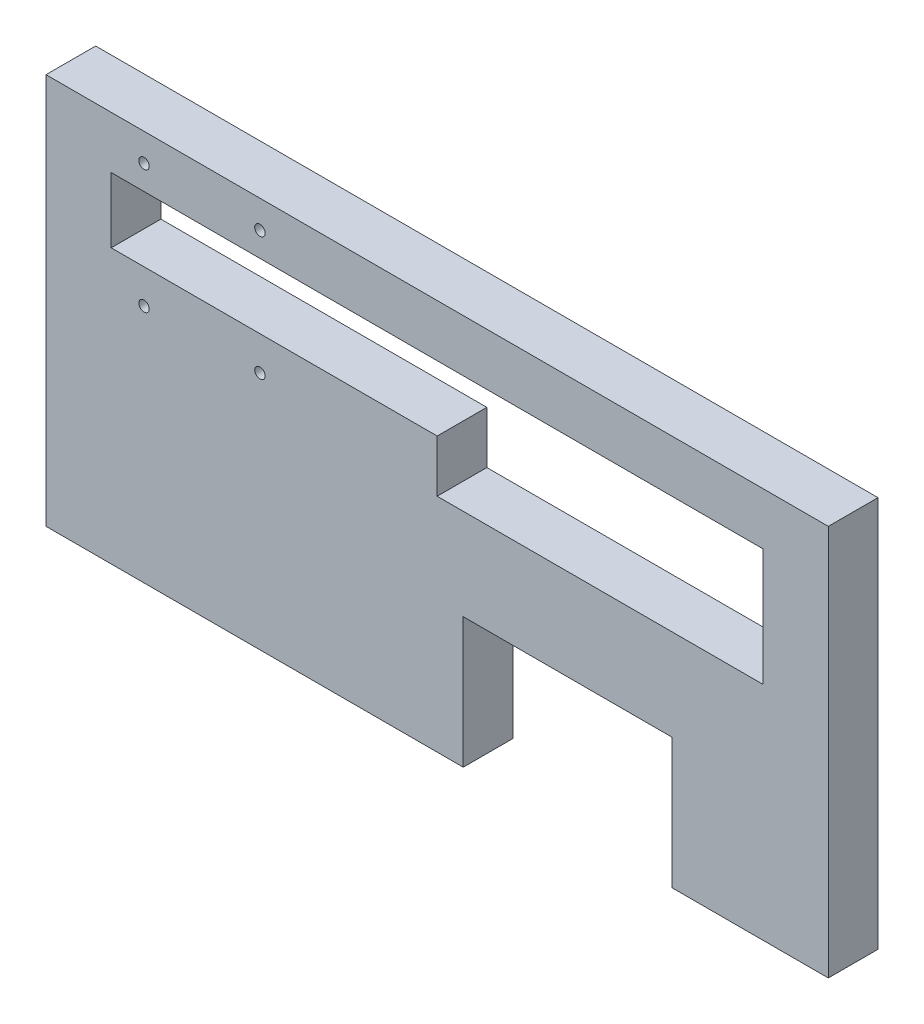
ISO-10303-21;
HEADER;
FILE_DESCRIPTION(('STEP AP214'),'2;1');
FILE_NAME('part.step','',(''),(''),'','','');
FILE_SCHEMA(('AUTOMOTIVE_DESIGN { 1 0 10303 214 1 1 1 1 }'));
ENDSEC;
DATA;
#1=APPLICATION_CONTEXT('core data for automotive mechanical design processes');
#2=APPLICATION_PROTOCOL_DEFINITION('international standard','automotive_design',2000,#1);
#3=PRODUCT_CONTEXT('',#1,'mechanical');
#4=PRODUCT('Part','Part','',(#3));
#5=PRODUCT_RELATED_PRODUCT_CATEGORY('part','',(#4));
#6=PRODUCT_DEFINITION_FORMATION('','',#4);
#7=PRODUCT_DEFINITION_CONTEXT('part definition',#1,'design');
#8=PRODUCT_DEFINITION('design','',#6,#7);
#9=PRODUCT_DEFINITION_SHAPE('','',#8);
#10=(LENGTH_UNIT() NAMED_UNIT(*) SI_UNIT(.MILLI.,.METRE.));
#11=(NAMED_UNIT(*) PLANE_ANGLE_UNIT() SI_UNIT($,.RADIAN.));
#12=(NAMED_UNIT(*) SI_UNIT($,.STERADIAN.) SOLID_ANGLE_UNIT());
#13=UNCERTAINTY_MEASURE_WITH_UNIT(LENGTH_MEASURE(1.E-05),#10,'distance_accuracy_value','');
#14=(GEOMETRIC_REPRESENTATION_CONTEXT(3) GLOBAL_UNCERTAINTY_ASSIGNED_CONTEXT((#13)) GLOBAL_UNIT_ASSIGNED_CONTEXT((#10,
#11,#12)) REPRESENTATION_CONTEXT('',''));
#15=CARTESIAN_POINT('',(0.,0.,0.));
#16=DIRECTION('',(0.,0.,1.));
#17=DIRECTION('',(1.,0.,0.));
#18=AXIS2_PLACEMENT_3D('',#15,#16,#17);
#19=CARTESIAN_POINT('',(0.,0.,-19.05));
#20=DIRECTION('',(0.,-1.,0.));
#21=DIRECTION('',(0.,0.,-1.));
#22=AXIS2_PLACEMENT_3D('',#19,#20,#21);
#23=PLANE('',#22);
#24=DIRECTION('',(0.,0.,1.));
#25=VECTOR('',#24,1.);
#26=CARTESIAN_POINT('',(240.,0.,-19.05));
#27=LINE('',#26,#25);
#28=CARTESIAN_POINT('',(240.,0.,-19.05));
#29=VERTEX_POINT('',#28);
#30=CARTESIAN_POINT('',(240.,0.,0.));
#31=VERTEX_POINT('',#30);
#32=EDGE_CURVE('E167',#29,#31,#27,.T.);
#33=ORIENTED_EDGE('',*,*,#32,.F.);
#34=DIRECTION('',(1.,0.,0.));
#35=VECTOR('',#34,1.);
#36=CARTESIAN_POINT('',(0.,0.,-19.05));
#37=LINE('',#36,#35);
#38=CARTESIAN_POINT('',(300.,0.,-19.05));
#39=VERTEX_POINT('',#38);
#40=EDGE_CURVE('E154',#29,#39,#37,.T.);
#41=ORIENTED_EDGE('',*,*,#40,.T.);
#42=DIRECTION('',(0.,0.,1.));
#43=VECTOR('',#42,1.);
#44=CARTESIAN_POINT('',(300.,0.,-19.05));
#45=LINE('',#44,#43);
#46=CARTESIAN_POINT('',(300.,0.,0.));
#47=VERTEX_POINT('',#46);
#48=EDGE_CURVE('E245',#39,#47,#45,.T.);
#49=ORIENTED_EDGE('',*,*,#48,.T.);
#50=DIRECTION('',(1.,0.,0.));
#51=VECTOR('',#50,1.);
#52=CARTESIAN_POINT('',(0.,0.,0.));
#53=LINE('',#52,#51);
#54=EDGE_CURVE('E236',#31,#47,#53,.T.);
#55=ORIENTED_EDGE('',*,*,#54,.F.);
#56=EDGE_LOOP('',(#33,#41,#49,#55));
#57=FACE_BOUND('',#56,.T.);
#58=ADVANCED_FACE('F32',(#57),#23,.T.);
#59=CARTESIAN_POINT('',(0.,0.,-19.05));
#60=DIRECTION('',(-1.,0.,0.));
#61=DIRECTION('',(0.,0.,1.));
#62=AXIS2_PLACEMENT_3D('',#59,#60,#61);
#63=PLANE('',#62);
#64=DIRECTION('',(0.,-1.,0.));
#65=VECTOR('',#64,1.);
#66=CARTESIAN_POINT('',(0.,0.,0.));
#67=LINE('',#66,#65);
#68=CARTESIAN_POINT('',(0.,150.,0.));
#69=VERTEX_POINT('',#68);
#70=CARTESIAN_POINT('',(0.,0.,0.));
#71=VERTEX_POINT('',#70);
#72=EDGE_CURVE('E220',#69,#71,#67,.T.);
#73=ORIENTED_EDGE('',*,*,#72,.F.);
#74=DIRECTION('',(0.,0.,1.));
#75=VECTOR('',#74,1.);
#76=CARTESIAN_POINT('',(0.,150.,-19.05));
#77=LINE('',#76,#75);
#78=CARTESIAN_POINT('',(0.,150.,-19.05));
#79=VERTEX_POINT('',#78);
#80=EDGE_CURVE('E11',#79,#69,#77,.T.);
#81=ORIENTED_EDGE('',*,*,#80,.F.);
#82=DIRECTION('',(0.,-1.,0.));
#83=VECTOR('',#82,1.);
#84=CARTESIAN_POINT('',(0.,0.,-19.05));
#85=LINE('',#84,#83);
#86=CARTESIAN_POINT('',(0.,0.,-19.05));
#87=VERTEX_POINT('',#86);
#88=EDGE_CURVE('E221',#79,#87,#85,.T.);
#89=ORIENTED_EDGE('',*,*,#88,.T.);
#90=DIRECTION('',(0.,0.,1.));
#91=VECTOR('',#90,1.);
#92=CARTESIAN_POINT('',(0.,0.,-19.05));
#93=LINE('',#92,#91);
#94=EDGE_CURVE('E36',#87,#71,#93,.T.);
#95=ORIENTED_EDGE('',*,*,#94,.T.);
#96=EDGE_LOOP('',(#73,#81,#89,#95));
#97=FACE_BOUND('',#96,.T.);
#98=ADVANCED_FACE('F34',(#97),#63,.T.);
#99=CARTESIAN_POINT('',(0.,150.,-19.05));
#100=DIRECTION('',(0.,1.,0.));
#101=DIRECTION('',(0.,0.,1.));
#102=AXIS2_PLACEMENT_3D('',#99,#100,#101);
#103=PLANE('',#102);
#104=DIRECTION('',(-1.,0.,0.));
#105=VECTOR('',#104,1.);
#106=CARTESIAN_POINT('',(0.,150.,0.));
#107=LINE('',#106,#105);
#108=CARTESIAN_POINT('',(300.,150.,0.));
#109=VERTEX_POINT('',#108);
#110=EDGE_CURVE('E224',#109,#69,#107,.T.);
#111=ORIENTED_EDGE('',*,*,#110,.F.);
#112=DIRECTION('',(0.,0.,1.));
#113=VECTOR('',#112,1.);
#114=CARTESIAN_POINT('',(300.,150.,-19.05));
#115=LINE('',#114,#113);
#116=CARTESIAN_POINT('',(300.,150.,-19.05));
#117=VERTEX_POINT('',#116);
#118=EDGE_CURVE('E41',#117,#109,#115,.T.);
#119=ORIENTED_EDGE('',*,*,#118,.F.);
#120=DIRECTION('',(-1.,0.,0.));
#121=VECTOR('',#120,1.);
#122=CARTESIAN_POINT('',(0.,150.,-19.05));
#123=LINE('',#122,#121);
#124=EDGE_CURVE('E231',#117,#79,#123,.T.);
#125=ORIENTED_EDGE('',*,*,#124,.T.);
#126=ORIENTED_EDGE('',*,*,#80,.T.);
#127=EDGE_LOOP('',(#111,#119,#125,#126));
#128=FACE_BOUND('',#127,.T.);
#129=ADVANCED_FACE('F263',(#128),#103,.T.);
#130=CARTESIAN_POINT('',(300.,0.,-19.05));
#131=DIRECTION('',(1.,0.,0.));
#132=DIRECTION('',(0.,0.,-1.));
#133=AXIS2_PLACEMENT_3D('',#130,#131,#132);
#134=PLANE('',#133);
#135=DIRECTION('',(0.,1.,0.));
#136=VECTOR('',#135,1.);
#137=CARTESIAN_POINT('',(300.,0.,0.));
#138=LINE('',#137,#136);
#139=EDGE_CURVE('E240',#47,#109,#138,.T.);
#140=ORIENTED_EDGE('',*,*,#139,.F.);
#141=ORIENTED_EDGE('',*,*,#48,.F.);
#142=DIRECTION('',(0.,1.,0.));
#143=VECTOR('',#142,1.);
#144=CARTESIAN_POINT('',(300.,0.,-19.05));
#145=LINE('',#144,#143);
#146=EDGE_CURVE('E228',#39,#117,#145,.T.);
#147=ORIENTED_EDGE('',*,*,#146,.T.);
#148=ORIENTED_EDGE('',*,*,#118,.T.);
#149=EDGE_LOOP('',(#140,#141,#147,#148));
#150=FACE_BOUND('',#149,.T.);
#151=ADVANCED_FACE('F268',(#150),#134,.T.);
#152=DIRECTION('',(0.,0.,1.));
#153=VECTOR('',#152,1.);
#154=CARTESIAN_POINT('',(160.,0.,-19.05));
#155=LINE('',#154,#153);
#156=CARTESIAN_POINT('',(160.,0.,-19.05));
#157=VERTEX_POINT('',#156);
#158=CARTESIAN_POINT('',(160.,0.,0.));
#159=VERTEX_POINT('',#158);
#160=EDGE_CURVE('E170',#157,#159,#155,.T.);
#161=ORIENTED_EDGE('',*,*,#160,.T.);
#162=EDGE_CURVE('E237',#71,#159,#53,.T.);
#163=ORIENTED_EDGE('',*,*,#162,.F.);
#164=ORIENTED_EDGE('',*,*,#94,.F.);
#165=EDGE_CURVE('E225',#87,#157,#37,.T.);
#166=ORIENTED_EDGE('',*,*,#165,.T.);
#167=EDGE_LOOP('',(#161,#163,#164,#166));
#168=FACE_BOUND('',#167,.T.);
#169=ADVANCED_FACE('F257',(#168),#23,.T.);
#170=CARTESIAN_POINT('',(0.,150.,-19.05));
#171=DIRECTION('',(0.,0.,-1.));
#172=DIRECTION('',(-1.,0.,0.));
#173=AXIS2_PLACEMENT_3D('',#170,#171,#172);
#174=PLANE('',#173);
#175=CARTESIAN_POINT('',(82.0374999999982,91.95,-19.05));
#176=DIRECTION('',(0.,0.,1.));
#177=DIRECTION('',(1.,0.,0.));
#178=AXIS2_PLACEMENT_3D('',#175,#176,#177);
#179=CIRCLE('',#178,2.);
#180=CARTESIAN_POINT('',(84.0374999999982,91.95,-19.05));
#181=VERTEX_POINT('',#180);
#182=EDGE_CURVE('E468',#181,#181,#179,.T.);
#183=ORIENTED_EDGE('',*,*,#182,.T.);
#184=EDGE_LOOP('',(#183));
#185=FACE_BOUND('',#184,.T.);
#186=CARTESIAN_POINT('',(37.5874999999982,91.95,-19.05));
#187=DIRECTION('',(0.,0.,1.));
#188=DIRECTION('',(1.,0.,0.));
#189=AXIS2_PLACEMENT_3D('',#186,#187,#188);
#190=CIRCLE('',#189,2.);
#191=CARTESIAN_POINT('',(39.5874999999982,91.95,-19.05));
#192=VERTEX_POINT('',#191);
#193=EDGE_CURVE('E464',#192,#192,#190,.T.);
#194=ORIENTED_EDGE('',*,*,#193,.T.);
#195=EDGE_LOOP('',(#194));
#196=FACE_BOUND('',#195,.T.);
#197=CARTESIAN_POINT('',(82.0374999999982,139.35,-19.05));
#198=DIRECTION('',(0.,0.,1.));
#199=DIRECTION('',(1.,0.,0.));
#200=AXIS2_PLACEMENT_3D('',#197,#198,#199);
#201=CIRCLE('',#200,2.);
#202=CARTESIAN_POINT('',(84.0374999999982,139.35,-19.05));
#203=VERTEX_POINT('',#202);
#204=EDGE_CURVE('E458',#203,#203,#201,.T.);
#205=ORIENTED_EDGE('',*,*,#204,.T.);
#206=EDGE_LOOP('',(#205));
#207=FACE_BOUND('',#206,.T.);
#208=CARTESIAN_POINT('',(37.5874999999982,139.35,-19.05));
#209=DIRECTION('',(0.,0.,1.));
#210=DIRECTION('',(1.,0.,0.));
#211=AXIS2_PLACEMENT_3D('',#208,#209,#210);
#212=CIRCLE('',#211,2.);
#213=CARTESIAN_POINT('',(39.5874999999982,139.35,-19.05));
#214=VERTEX_POINT('',#213);
#215=EDGE_CURVE('E165',#214,#214,#212,.T.);
#216=ORIENTED_EDGE('',*,*,#215,.T.);
#217=EDGE_LOOP('',(#216));
#218=FACE_BOUND('',#217,.T.);
#219=DIRECTION('',(0.,1.,0.));
#220=VECTOR('',#219,1.);
#221=CARTESIAN_POINT('',(240.,0.,-19.05));
#222=LINE('',#221,#220);
#223=CARTESIAN_POINT('',(240.,50.,-19.05));
#224=VERTEX_POINT('',#223);
#225=EDGE_CURVE('E135',#29,#224,#222,.T.);
#226=ORIENTED_EDGE('',*,*,#225,.T.);
#227=DIRECTION('',(-1.,0.,0.));
#228=VECTOR('',#227,1.);
#229=CARTESIAN_POINT('',(240.,50.,-19.05));
#230=LINE('',#229,#228);
#231=CARTESIAN_POINT('',(160.,50.,-19.05));
#232=VERTEX_POINT('',#231);
#233=EDGE_CURVE('E144',#224,#232,#230,.T.);
#234=ORIENTED_EDGE('',*,*,#233,.T.);
#235=DIRECTION('',(0.,-1.,0.));
#236=VECTOR('',#235,1.);
#237=CARTESIAN_POINT('',(160.,0.,-19.05));
#238=LINE('',#237,#236);
#239=EDGE_CURVE('E141',#232,#157,#238,.T.);
#240=ORIENTED_EDGE('',*,*,#239,.T.);
#241=ORIENTED_EDGE('',*,*,#165,.F.);
#242=ORIENTED_EDGE('',*,*,#88,.F.);
#243=ORIENTED_EDGE('',*,*,#124,.F.);
#244=ORIENTED_EDGE('',*,*,#146,.F.);
#245=ORIENTED_EDGE('',*,*,#40,.F.);
#246=EDGE_LOOP('',(#226,#234,#240,#241,#242,#243,#244,#245));
#247=FACE_BOUND('',#246,.T.);
#248=DIRECTION('',(1.,0.,0.));
#249=VECTOR('',#248,1.);
#250=CARTESIAN_POINT('',(275.,85.,-19.05));
#251=LINE('',#250,#249);
#252=CARTESIAN_POINT('',(150.,85.,-19.05));
#253=VERTEX_POINT('',#252);
#254=CARTESIAN_POINT('',(275.,85.,-19.05));
#255=VERTEX_POINT('',#254);
#256=EDGE_CURVE('E177',#253,#255,#251,.T.);
#257=ORIENTED_EDGE('',*,*,#256,.T.);
#258=DIRECTION('',(0.,1.,0.));
#259=VECTOR('',#258,1.);
#260=CARTESIAN_POINT('',(275.,130.,-19.05));
#261=LINE('',#260,#259);
#262=CARTESIAN_POINT('',(275.,130.,-19.05));
#263=VERTEX_POINT('',#262);
#264=EDGE_CURVE('E205',#255,#263,#261,.T.);
#265=ORIENTED_EDGE('',*,*,#264,.T.);
#266=DIRECTION('',(-1.,0.,0.));
#267=VECTOR('',#266,1.);
#268=CARTESIAN_POINT('',(25.,130.,-19.05));
#269=LINE('',#268,#267);
#270=CARTESIAN_POINT('',(25.,130.,-19.05));
#271=VERTEX_POINT('',#270);
#272=EDGE_CURVE('E210',#263,#271,#269,.T.);
#273=ORIENTED_EDGE('',*,*,#272,.T.);
#274=DIRECTION('',(0.,-1.,0.));
#275=VECTOR('',#274,1.);
#276=CARTESIAN_POINT('',(25.,130.,-19.05));
#277=LINE('',#276,#275);
#278=CARTESIAN_POINT('',(25.,105.,-19.05));
#279=VERTEX_POINT('',#278);
#280=EDGE_CURVE('E206',#271,#279,#277,.T.);
#281=ORIENTED_EDGE('',*,*,#280,.T.);
#282=DIRECTION('',(1.,0.,0.));
#283=VECTOR('',#282,1.);
#284=CARTESIAN_POINT('',(25.,105.,-19.05));
#285=LINE('',#284,#283);
#286=CARTESIAN_POINT('',(150.,105.,-19.05));
#287=VERTEX_POINT('',#286);
#288=EDGE_CURVE('E195',#279,#287,#285,.T.);
#289=ORIENTED_EDGE('',*,*,#288,.T.);
#290=DIRECTION('',(0.,-1.,0.));
#291=VECTOR('',#290,1.);
#292=CARTESIAN_POINT('',(150.,105.,-19.05));
#293=LINE('',#292,#291);
#294=EDGE_CURVE('E174',#287,#253,#293,.T.);
#295=ORIENTED_EDGE('',*,*,#294,.T.);
#296=EDGE_LOOP('',(#257,#265,#273,#281,#289,#295));
#297=FACE_BOUND('',#296,.T.);
#298=ADVANCED_FACE('F151',(#185,#196,#207,#218,#247,#297),#174,.T.);
#299=CARTESIAN_POINT('',(0.,150.,0.));
#300=DIRECTION('',(0.,0.,-1.));
#301=DIRECTION('',(-1.,0.,0.));
#302=AXIS2_PLACEMENT_3D('',#299,#300,#301);
#303=PLANE('',#302);
#304=CARTESIAN_POINT('',(82.0374999999982,91.95,0.));
#305=DIRECTION('',(0.,0.,1.));
#306=DIRECTION('',(1.,0.,0.));
#307=AXIS2_PLACEMENT_3D('',#304,#305,#306);
#308=CIRCLE('',#307,2.);
#309=CARTESIAN_POINT('',(84.0374999999982,91.95,0.));
#310=VERTEX_POINT('',#309);
#311=EDGE_CURVE('E435',#310,#310,#308,.T.);
#312=ORIENTED_EDGE('',*,*,#311,.F.);
#313=EDGE_LOOP('',(#312));
#314=FACE_BOUND('',#313,.T.);
#315=CARTESIAN_POINT('',(37.5874999999982,91.95,0.));
#316=DIRECTION('',(0.,0.,1.));
#317=DIRECTION('',(1.,0.,0.));
#318=AXIS2_PLACEMENT_3D('',#315,#316,#317);
#319=CIRCLE('',#318,2.);
#320=CARTESIAN_POINT('',(39.5874999999982,91.95,0.));
#321=VERTEX_POINT('',#320);
#322=EDGE_CURVE('E439',#321,#321,#319,.T.);
#323=ORIENTED_EDGE('',*,*,#322,.F.);
#324=EDGE_LOOP('',(#323));
#325=FACE_BOUND('',#324,.T.);
#326=CARTESIAN_POINT('',(82.0374999999982,139.35,0.));
#327=DIRECTION('',(0.,0.,1.));
#328=DIRECTION('',(1.,0.,0.));
#329=AXIS2_PLACEMENT_3D('',#326,#327,#328);
#330=CIRCLE('',#329,2.);
#331=CARTESIAN_POINT('',(84.0374999999982,139.35,0.));
#332=VERTEX_POINT('',#331);
#333=EDGE_CURVE('E443',#332,#332,#330,.T.);
#334=ORIENTED_EDGE('',*,*,#333,.F.);
#335=EDGE_LOOP('',(#334));
#336=FACE_BOUND('',#335,.T.);
#337=CARTESIAN_POINT('',(37.5874999999982,139.35,0.));
#338=DIRECTION('',(0.,0.,1.));
#339=DIRECTION('',(1.,0.,0.));
#340=AXIS2_PLACEMENT_3D('',#337,#338,#339);
#341=CIRCLE('',#340,2.);
#342=CARTESIAN_POINT('',(39.5874999999982,139.35,0.));
#343=VERTEX_POINT('',#342);
#344=EDGE_CURVE('E160',#343,#343,#341,.T.);
#345=ORIENTED_EDGE('',*,*,#344,.F.);
#346=EDGE_LOOP('',(#345));
#347=FACE_BOUND('',#346,.T.);
#348=DIRECTION('',(0.,1.,0.));
#349=VECTOR('',#348,1.);
#350=CARTESIAN_POINT('',(275.,130.,0.));
#351=LINE('',#350,#349);
#352=CARTESIAN_POINT('',(275.,85.,0.));
#353=VERTEX_POINT('',#352);
#354=CARTESIAN_POINT('',(275.,130.,0.));
#355=VERTEX_POINT('',#354);
#356=EDGE_CURVE('E196',#353,#355,#351,.T.);
#357=ORIENTED_EDGE('',*,*,#356,.F.);
#358=DIRECTION('',(1.,0.,0.));
#359=VECTOR('',#358,1.);
#360=CARTESIAN_POINT('',(275.,85.,0.));
#361=LINE('',#360,#359);
#362=CARTESIAN_POINT('',(150.,85.,0.));
#363=VERTEX_POINT('',#362);
#364=EDGE_CURVE('E178',#363,#353,#361,.T.);
#365=ORIENTED_EDGE('',*,*,#364,.F.);
#366=DIRECTION('',(0.,-1.,0.));
#367=VECTOR('',#366,1.);
#368=CARTESIAN_POINT('',(150.,105.,0.));
#369=LINE('',#368,#367);
#370=CARTESIAN_POINT('',(150.,105.,0.));
#371=VERTEX_POINT('',#370);
#372=EDGE_CURVE('E169',#371,#363,#369,.T.);
#373=ORIENTED_EDGE('',*,*,#372,.F.);
#374=DIRECTION('',(1.,0.,0.));
#375=VECTOR('',#374,1.);
#376=CARTESIAN_POINT('',(25.,105.,0.));
#377=LINE('',#376,#375);
#378=CARTESIAN_POINT('',(25.,105.,0.));
#379=VERTEX_POINT('',#378);
#380=EDGE_CURVE('E199',#379,#371,#377,.T.);
#381=ORIENTED_EDGE('',*,*,#380,.F.);
#382=DIRECTION('',(0.,-1.,0.));
#383=VECTOR('',#382,1.);
#384=CARTESIAN_POINT('',(25.,130.,0.));
#385=LINE('',#384,#383);
#386=CARTESIAN_POINT('',(25.,130.,0.));
#387=VERTEX_POINT('',#386);
#388=EDGE_CURVE('E189',#387,#379,#385,.T.);
#389=ORIENTED_EDGE('',*,*,#388,.F.);
#390=DIRECTION('',(-1.,0.,0.));
#391=VECTOR('',#390,1.);
#392=CARTESIAN_POINT('',(25.,130.,0.));
#393=LINE('',#392,#391);
#394=EDGE_CURVE('E193',#355,#387,#393,.T.);
#395=ORIENTED_EDGE('',*,*,#394,.F.);
#396=EDGE_LOOP('',(#357,#365,#373,#381,#389,#395));
#397=FACE_BOUND('',#396,.T.);
#398=DIRECTION('',(-1.,0.,0.));
#399=VECTOR('',#398,1.);
#400=CARTESIAN_POINT('',(240.,50.,0.));
#401=LINE('',#400,#399);
#402=CARTESIAN_POINT('',(240.,50.,0.));
#403=VERTEX_POINT('',#402);
#404=CARTESIAN_POINT('',(160.,50.,0.));
#405=VERTEX_POINT('',#404);
#406=EDGE_CURVE('E157',#403,#405,#401,.T.);
#407=ORIENTED_EDGE('',*,*,#406,.F.);
#408=DIRECTION('',(0.,1.,0.));
#409=VECTOR('',#408,1.);
#410=CARTESIAN_POINT('',(240.,0.,0.));
#411=LINE('',#410,#409);
#412=EDGE_CURVE('E49',#31,#403,#411,.T.);
#413=ORIENTED_EDGE('',*,*,#412,.F.);
#414=ORIENTED_EDGE('',*,*,#54,.T.);
#415=ORIENTED_EDGE('',*,*,#139,.T.);
#416=ORIENTED_EDGE('',*,*,#110,.T.);
#417=ORIENTED_EDGE('',*,*,#72,.T.);
#418=ORIENTED_EDGE('',*,*,#162,.T.);
#419=DIRECTION('',(0.,-1.,0.));
#420=VECTOR('',#419,1.);
#421=CARTESIAN_POINT('',(160.,0.,0.));
#422=LINE('',#421,#420);
#423=EDGE_CURVE('E155',#405,#159,#422,.T.);
#424=ORIENTED_EDGE('',*,*,#423,.F.);
#425=EDGE_LOOP('',(#407,#413,#414,#415,#416,#417,#418,#424));
#426=FACE_BOUND('',#425,.T.);
#427=ADVANCED_FACE('F260',(#314,#325,#336,#347,#397,#426),#303,.F.);
#428=CARTESIAN_POINT('',(25.,105.,-270.296890528022));
#429=DIRECTION('',(0.,-1.,0.));
#430=DIRECTION('',(0.,0.,-1.));
#431=AXIS2_PLACEMENT_3D('',#428,#429,#430);
#432=PLANE('',#431);
#433=ORIENTED_EDGE('',*,*,#380,.T.);
#434=DIRECTION('',(0.,0.,1.));
#435=VECTOR('',#434,1.);
#436=CARTESIAN_POINT('',(150.,105.,-19.05));
#437=LINE('',#436,#435);
#438=EDGE_CURVE('E181',#287,#371,#437,.T.);
#439=ORIENTED_EDGE('',*,*,#438,.F.);
#440=ORIENTED_EDGE('',*,*,#288,.F.);
#441=DIRECTION('',(0.,0.,1.));
#442=VECTOR('',#441,1.);
#443=CARTESIAN_POINT('',(25.,105.,-270.296890528022));
#444=LINE('',#443,#442);
#445=EDGE_CURVE('E57',#279,#379,#444,.T.);
#446=ORIENTED_EDGE('',*,*,#445,.T.);
#447=EDGE_LOOP('',(#433,#439,#440,#446));
#448=FACE_BOUND('',#447,.T.);
#449=ADVANCED_FACE('F323',(#448),#432,.F.);
#450=CARTESIAN_POINT('',(275.,130.,-270.296890528022));
#451=DIRECTION('',(1.,0.,0.));
#452=DIRECTION('',(0.,1.,0.));
#453=AXIS2_PLACEMENT_3D('',#450,#451,#452);
#454=PLANE('',#453);
#455=ORIENTED_EDGE('',*,*,#264,.F.);
#456=DIRECTION('',(0.,0.,1.));
#457=VECTOR('',#456,1.);
#458=CARTESIAN_POINT('',(275.,85.,-19.05));
#459=LINE('',#458,#457);
#460=EDGE_CURVE('E186',#255,#353,#459,.T.);
#461=ORIENTED_EDGE('',*,*,#460,.T.);
#462=ORIENTED_EDGE('',*,*,#356,.T.);
#463=DIRECTION('',(0.,0.,1.));
#464=VECTOR('',#463,1.);
#465=CARTESIAN_POINT('',(275.,130.,-270.296890528022));
#466=LINE('',#465,#464);
#467=EDGE_CURVE('E213',#263,#355,#466,.T.);
#468=ORIENTED_EDGE('',*,*,#467,.F.);
#469=EDGE_LOOP('',(#455,#461,#462,#468));
#470=FACE_BOUND('',#469,.T.);
#471=ADVANCED_FACE('F304',(#470),#454,.F.);
#472=CARTESIAN_POINT('',(25.,130.,-270.296890528022));
#473=DIRECTION('',(0.,1.,0.));
#474=DIRECTION('',(0.,0.,1.));
#475=AXIS2_PLACEMENT_3D('',#472,#473,#474);
#476=PLANE('',#475);
#477=ORIENTED_EDGE('',*,*,#467,.T.);
#478=ORIENTED_EDGE('',*,*,#394,.T.);
#479=DIRECTION('',(0.,0.,1.));
#480=VECTOR('',#479,1.);
#481=CARTESIAN_POINT('',(25.,130.,-270.296890528022));
#482=LINE('',#481,#480);
#483=EDGE_CURVE('E209',#271,#387,#482,.T.);
#484=ORIENTED_EDGE('',*,*,#483,.F.);
#485=ORIENTED_EDGE('',*,*,#272,.F.);
#486=EDGE_LOOP('',(#477,#478,#484,#485));
#487=FACE_BOUND('',#486,.T.);
#488=ADVANCED_FACE('F298',(#487),#476,.F.);
#489=CARTESIAN_POINT('',(25.,130.,-270.296890528022));
#490=DIRECTION('',(-1.,0.,0.));
#491=DIRECTION('',(0.,-1.,0.));
#492=AXIS2_PLACEMENT_3D('',#489,#490,#491);
#493=PLANE('',#492);
#494=ORIENTED_EDGE('',*,*,#483,.T.);
#495=ORIENTED_EDGE('',*,*,#388,.T.);
#496=ORIENTED_EDGE('',*,*,#445,.F.);
#497=ORIENTED_EDGE('',*,*,#280,.F.);
#498=EDGE_LOOP('',(#494,#495,#496,#497));
#499=FACE_BOUND('',#498,.T.);
#500=ADVANCED_FACE('F303',(#499),#493,.F.);
#501=CARTESIAN_POINT('',(275.,85.,-19.05));
#502=DIRECTION('',(0.,-1.,0.));
#503=DIRECTION('',(1.,0.,0.));
#504=AXIS2_PLACEMENT_3D('',#501,#502,#503);
#505=PLANE('',#504);
#506=ORIENTED_EDGE('',*,*,#364,.T.);
#507=ORIENTED_EDGE('',*,*,#460,.F.);
#508=ORIENTED_EDGE('',*,*,#256,.F.);
#509=DIRECTION('',(0.,0.,1.));
#510=VECTOR('',#509,1.);
#511=CARTESIAN_POINT('',(150.,85.,-19.05));
#512=LINE('',#511,#510);
#513=EDGE_CURVE('E190',#253,#363,#512,.T.);
#514=ORIENTED_EDGE('',*,*,#513,.T.);
#515=EDGE_LOOP('',(#506,#507,#508,#514));
#516=FACE_BOUND('',#515,.T.);
#517=ADVANCED_FACE('F316',(#516),#505,.F.);
#518=CARTESIAN_POINT('',(150.,105.,-19.05));
#519=DIRECTION('',(-1.,0.,0.));
#520=DIRECTION('',(0.,0.,1.));
#521=AXIS2_PLACEMENT_3D('',#518,#519,#520);
#522=PLANE('',#521);
#523=ORIENTED_EDGE('',*,*,#372,.T.);
#524=ORIENTED_EDGE('',*,*,#513,.F.);
#525=ORIENTED_EDGE('',*,*,#294,.F.);
#526=ORIENTED_EDGE('',*,*,#438,.T.);
#527=EDGE_LOOP('',(#523,#524,#525,#526));
#528=FACE_BOUND('',#527,.T.);
#529=ADVANCED_FACE('F341',(#528),#522,.F.);
#530=CARTESIAN_POINT('',(240.,0.,-19.05));
#531=DIRECTION('',(1.,0.,0.));
#532=DIRECTION('',(0.,0.,-1.));
#533=AXIS2_PLACEMENT_3D('',#530,#531,#532);
#534=PLANE('',#533);
#535=ORIENTED_EDGE('',*,*,#412,.T.);
#536=DIRECTION('',(0.,0.,1.));
#537=VECTOR('',#536,1.);
#538=CARTESIAN_POINT('',(240.,50.,-19.05));
#539=LINE('',#538,#537);
#540=EDGE_CURVE('E131',#224,#403,#539,.T.);
#541=ORIENTED_EDGE('',*,*,#540,.F.);
#542=ORIENTED_EDGE('',*,*,#225,.F.);
#543=ORIENTED_EDGE('',*,*,#32,.T.);
#544=EDGE_LOOP('',(#535,#541,#542,#543));
#545=FACE_BOUND('',#544,.T.);
#546=ADVANCED_FACE('F133',(#545),#534,.F.);
#547=CARTESIAN_POINT('',(160.,0.,-19.05));
#548=DIRECTION('',(-1.,0.,0.));
#549=DIRECTION('',(0.,0.,1.));
#550=AXIS2_PLACEMENT_3D('',#547,#548,#549);
#551=PLANE('',#550);
#552=ORIENTED_EDGE('',*,*,#423,.T.);
#553=ORIENTED_EDGE('',*,*,#160,.F.);
#554=ORIENTED_EDGE('',*,*,#239,.F.);
#555=DIRECTION('',(0.,0.,1.));
#556=VECTOR('',#555,1.);
#557=CARTESIAN_POINT('',(160.,50.,-19.05));
#558=LINE('',#557,#556);
#559=EDGE_CURVE('E140',#232,#405,#558,.T.);
#560=ORIENTED_EDGE('',*,*,#559,.T.);
#561=EDGE_LOOP('',(#552,#553,#554,#560));
#562=FACE_BOUND('',#561,.T.);
#563=ADVANCED_FACE('F266',(#562),#551,.F.);
#564=CARTESIAN_POINT('',(240.,50.,-19.05));
#565=DIRECTION('',(0.,1.,0.));
#566=DIRECTION('',(-1.,0.,0.));
#567=AXIS2_PLACEMENT_3D('',#564,#565,#566);
#568=PLANE('',#567);
#569=ORIENTED_EDGE('',*,*,#406,.T.);
#570=ORIENTED_EDGE('',*,*,#559,.F.);
#571=ORIENTED_EDGE('',*,*,#233,.F.);
#572=ORIENTED_EDGE('',*,*,#540,.T.);
#573=EDGE_LOOP('',(#569,#570,#571,#572));
#574=FACE_BOUND('',#573,.T.);
#575=ADVANCED_FACE('F145',(#574),#568,.F.);
#576=CARTESIAN_POINT('',(37.5874999999982,139.35,-19.05));
#577=DIRECTION('',(0.,0.,1.));
#578=DIRECTION('',(1.,0.,0.));
#579=AXIS2_PLACEMENT_3D('',#576,#577,#578);
#580=CYLINDRICAL_SURFACE('',#579,2.);
#581=ORIENTED_EDGE('',*,*,#215,.F.);
#582=EDGE_LOOP('',(#581));
#583=FACE_BOUND('',#582,.T.);
#584=ORIENTED_EDGE('',*,*,#344,.T.);
#585=EDGE_LOOP('',(#584));
#586=FACE_BOUND('',#585,.T.);
#587=ADVANCED_FACE('F375',(#583,#586),#580,.F.);
#588=CARTESIAN_POINT('',(82.0374999999982,139.35,-19.05));
#589=DIRECTION('',(0.,0.,1.));
#590=DIRECTION('',(1.,0.,0.));
#591=AXIS2_PLACEMENT_3D('',#588,#589,#590);
#592=CYLINDRICAL_SURFACE('',#591,2.);
#593=ORIENTED_EDGE('',*,*,#204,.F.);
#594=EDGE_LOOP('',(#593));
#595=FACE_BOUND('',#594,.T.);
#596=ORIENTED_EDGE('',*,*,#333,.T.);
#597=EDGE_LOOP('',(#596));
#598=FACE_BOUND('',#597,.T.);
#599=ADVANCED_FACE('F383',(#595,#598),#592,.F.);
#600=CARTESIAN_POINT('',(37.5874999999982,91.95,-19.05));
#601=DIRECTION('',(0.,0.,1.));
#602=DIRECTION('',(1.,0.,0.));
#603=AXIS2_PLACEMENT_3D('',#600,#601,#602);
#604=CYLINDRICAL_SURFACE('',#603,2.);
#605=ORIENTED_EDGE('',*,*,#193,.F.);
#606=EDGE_LOOP('',(#605));
#607=FACE_BOUND('',#606,.T.);
#608=ORIENTED_EDGE('',*,*,#322,.T.);
#609=EDGE_LOOP('',(#608));
#610=FACE_BOUND('',#609,.T.);
#611=ADVANCED_FACE('F392',(#607,#610),#604,.F.);
#612=CARTESIAN_POINT('',(82.0374999999982,91.95,-19.05));
#613=DIRECTION('',(0.,0.,1.));
#614=DIRECTION('',(1.,0.,0.));
#615=AXIS2_PLACEMENT_3D('',#612,#613,#614);
#616=CYLINDRICAL_SURFACE('',#615,2.);
#617=ORIENTED_EDGE('',*,*,#182,.F.);
#618=EDGE_LOOP('',(#617));
#619=FACE_BOUND('',#618,.T.);
#620=ORIENTED_EDGE('',*,*,#311,.T.);
#621=EDGE_LOOP('',(#620));
#622=FACE_BOUND('',#621,.T.);
#623=ADVANCED_FACE('F400',(#619,#622),#616,.F.);
#624=CLOSED_SHELL('',(#58,#98,#129,#151,#169,#298,#427,#449,#471,#488,#500,#517,#529,#546,#563,
#575,#587,#599,#611,#623));
#625=MANIFOLD_SOLID_BREP('B2',#624);
#626=ADVANCED_BREP_SHAPE_REPRESENTATION('',(#18,#625),#14);
#627=SHAPE_DEFINITION_REPRESENTATION(#9,#626);
ENDSEC;
END-ISO-10303-21;
